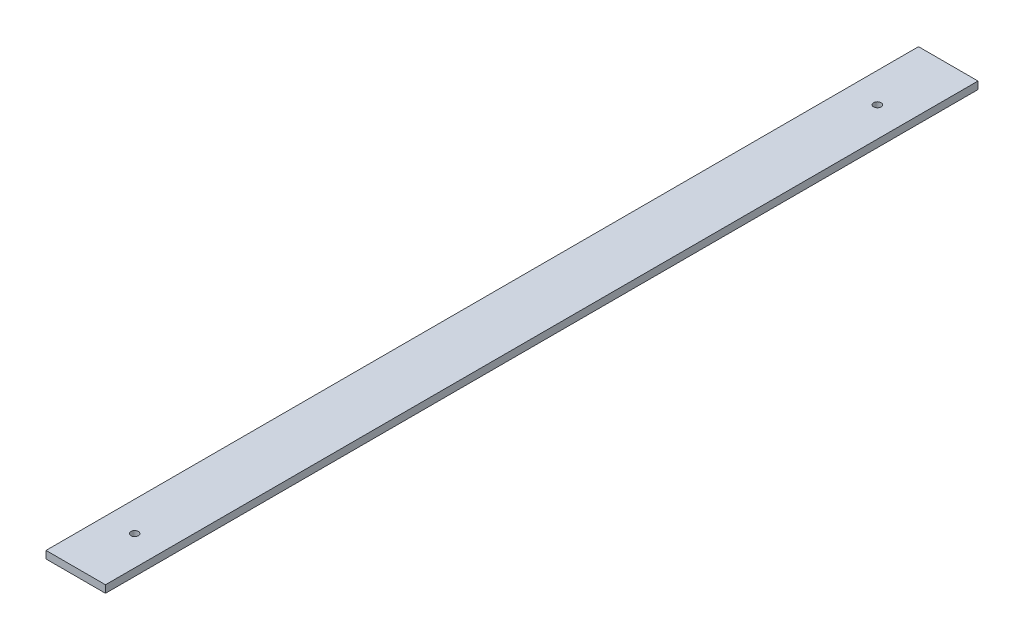
ISO-10303-21;
HEADER;
FILE_DESCRIPTION(('STEP AP214'),'2;1');
FILE_NAME('part.step','',(''),(''),'','','');
FILE_SCHEMA(('AUTOMOTIVE_DESIGN { 1 0 10303 214 1 1 1 1 }'));
ENDSEC;
DATA;
#1=APPLICATION_CONTEXT('core data for automotive mechanical design processes');
#2=APPLICATION_PROTOCOL_DEFINITION('international standard','automotive_design',2000,#1);
#3=PRODUCT_CONTEXT('',#1,'mechanical');
#4=PRODUCT('Part','Part','',(#3));
#5=PRODUCT_RELATED_PRODUCT_CATEGORY('part','',(#4));
#6=PRODUCT_DEFINITION_FORMATION('','',#4);
#7=PRODUCT_DEFINITION_CONTEXT('part definition',#1,'design');
#8=PRODUCT_DEFINITION('design','',#6,#7);
#9=PRODUCT_DEFINITION_SHAPE('','',#8);
#10=(LENGTH_UNIT() NAMED_UNIT(*) SI_UNIT(.MILLI.,.METRE.));
#11=(NAMED_UNIT(*) PLANE_ANGLE_UNIT() SI_UNIT($,.RADIAN.));
#12=(NAMED_UNIT(*) SI_UNIT($,.STERADIAN.) SOLID_ANGLE_UNIT());
#13=UNCERTAINTY_MEASURE_WITH_UNIT(LENGTH_MEASURE(1.E-05),#10,'distance_accuracy_value','');
#14=(GEOMETRIC_REPRESENTATION_CONTEXT(3) GLOBAL_UNCERTAINTY_ASSIGNED_CONTEXT((#13)) GLOBAL_UNIT_ASSIGNED_CONTEXT((#10,
#11,#12)) REPRESENTATION_CONTEXT('',''));
#15=CARTESIAN_POINT('',(0.,0.,0.));
#16=DIRECTION('',(0.,0.,1.));
#17=DIRECTION('',(1.,0.,0.));
#18=AXIS2_PLACEMENT_3D('',#15,#16,#17);
#19=CARTESIAN_POINT('',(0.,25.,0.));
#20=DIRECTION('',(0.,-1.,0.));
#21=DIRECTION('',(0.,0.,-1.));
#22=AXIS2_PLACEMENT_3D('',#19,#20,#21);
#23=PLANE('',#22);
#24=DIRECTION('',(0.,0.,-1.));
#25=VECTOR('',#24,1.);
#26=CARTESIAN_POINT('',(23232.9446458133,25.,9942.5828739722));
#27=LINE('',#26,#25);
#28=CARTESIAN_POINT('',(23232.9446458133,25.,12876.1567480987));
#29=VERTEX_POINT('',#28);
#30=CARTESIAN_POINT('',(23232.9446458133,25.,9942.5828739722));
#31=VERTEX_POINT('',#30);
#32=EDGE_CURVE('E102',#29,#31,#27,.T.);
#33=ORIENTED_EDGE('',*,*,#32,.T.);
#34=DIRECTION('',(-1.,0.,0.));
#35=VECTOR('',#34,1.);
#36=CARTESIAN_POINT('',(23232.9446458133,25.,9942.5828739722));
#37=LINE('',#36,#35);
#38=CARTESIAN_POINT('',(23032.9446458133,25.,9942.5828739722));
#39=VERTEX_POINT('',#38);
#40=EDGE_CURVE('E97',#31,#39,#37,.T.);
#41=ORIENTED_EDGE('',*,*,#40,.T.);
#42=DIRECTION('',(0.,0.,1.));
#43=VECTOR('',#42,1.);
#44=CARTESIAN_POINT('',(23032.9446458133,25.,9942.5828739722));
#45=LINE('',#44,#43);
#46=CARTESIAN_POINT('',(23032.9446458133,25.,12876.1567480987));
#47=VERTEX_POINT('',#46);
#48=EDGE_CURVE('E100',#39,#47,#45,.T.);
#49=ORIENTED_EDGE('',*,*,#48,.T.);
#50=DIRECTION('',(1.,0.,0.));
#51=VECTOR('',#50,1.);
#52=CARTESIAN_POINT('',(23232.9446458133,25.,12876.1567480987));
#53=LINE('',#52,#51);
#54=EDGE_CURVE('E67',#47,#29,#53,.T.);
#55=ORIENTED_EDGE('',*,*,#54,.T.);
#56=EDGE_LOOP('',(#33,#41,#49,#55));
#57=FACE_BOUND('',#56,.T.);
#58=CARTESIAN_POINT('',(23132.9446458133,25.,12678.089615367));
#59=DIRECTION('',(0.,1.,0.));
#60=DIRECTION('',(0.,0.,1.));
#61=AXIS2_PLACEMENT_3D('',#58,#59,#60);
#62=CIRCLE('',#61,12.4999999999988);
#63=CARTESIAN_POINT('',(23132.9446458133,25.,12690.589615367));
#64=VERTEX_POINT('',#63);
#65=EDGE_CURVE('E117',#64,#64,#62,.T.);
#66=ORIENTED_EDGE('',*,*,#65,.F.);
#67=EDGE_LOOP('',(#66));
#68=FACE_BOUND('',#67,.T.);
#69=CARTESIAN_POINT('',(23132.9446458133,25.,10181.0304593336));
#70=DIRECTION('',(0.,1.,0.));
#71=DIRECTION('',(0.,0.,1.));
#72=AXIS2_PLACEMENT_3D('',#69,#70,#71);
#73=CIRCLE('',#72,12.4999999999988);
#74=CARTESIAN_POINT('',(23132.9446458133,25.,10193.5304593336));
#75=VERTEX_POINT('',#74);
#76=EDGE_CURVE('E132',#75,#75,#73,.T.);
#77=ORIENTED_EDGE('',*,*,#76,.F.);
#78=EDGE_LOOP('',(#77));
#79=FACE_BOUND('',#78,.T.);
#80=ADVANCED_FACE('F50',(#57,#68,#79),#23,.F.);
#81=CARTESIAN_POINT('',(0.,0.,0.));
#82=DIRECTION('',(0.,-1.,0.));
#83=DIRECTION('',(0.,0.,-1.));
#84=AXIS2_PLACEMENT_3D('',#81,#82,#83);
#85=PLANE('',#84);
#86=CARTESIAN_POINT('',(23132.9446458133,0.,12678.089615367));
#87=DIRECTION('',(0.,1.,0.));
#88=DIRECTION('',(0.,0.,1.));
#89=AXIS2_PLACEMENT_3D('',#86,#87,#88);
#90=CIRCLE('',#89,12.4999999999988);
#91=CARTESIAN_POINT('',(23132.9446458133,0.,12690.589615367));
#92=VERTEX_POINT('',#91);
#93=EDGE_CURVE('E129',#92,#92,#90,.T.);
#94=ORIENTED_EDGE('',*,*,#93,.T.);
#95=EDGE_LOOP('',(#94));
#96=FACE_BOUND('',#95,.T.);
#97=DIRECTION('',(0.,0.,-1.));
#98=VECTOR('',#97,1.);
#99=CARTESIAN_POINT('',(23232.9446458133,0.,9942.5828739722));
#100=LINE('',#99,#98);
#101=CARTESIAN_POINT('',(23232.9446458133,0.,12876.1567480987));
#102=VERTEX_POINT('',#101);
#103=CARTESIAN_POINT('',(23232.9446458133,0.,9942.5828739722));
#104=VERTEX_POINT('',#103);
#105=EDGE_CURVE('E114',#102,#104,#100,.T.);
#106=ORIENTED_EDGE('',*,*,#105,.F.);
#107=DIRECTION('',(1.,0.,0.));
#108=VECTOR('',#107,1.);
#109=CARTESIAN_POINT('',(23232.9446458133,0.,12876.1567480987));
#110=LINE('',#109,#108);
#111=CARTESIAN_POINT('',(23032.9446458133,0.,12876.1567480987));
#112=VERTEX_POINT('',#111);
#113=EDGE_CURVE('E90',#112,#102,#110,.T.);
#114=ORIENTED_EDGE('',*,*,#113,.F.);
#115=DIRECTION('',(0.,0.,1.));
#116=VECTOR('',#115,1.);
#117=CARTESIAN_POINT('',(23032.9446458133,0.,9942.5828739722));
#118=LINE('',#117,#116);
#119=CARTESIAN_POINT('',(23032.9446458133,0.,9942.5828739722));
#120=VERTEX_POINT('',#119);
#121=EDGE_CURVE('E84',#120,#112,#118,.T.);
#122=ORIENTED_EDGE('',*,*,#121,.F.);
#123=DIRECTION('',(-1.,0.,0.));
#124=VECTOR('',#123,1.);
#125=CARTESIAN_POINT('',(23232.9446458133,0.,9942.5828739722));
#126=LINE('',#125,#124);
#127=EDGE_CURVE('E106',#104,#120,#126,.T.);
#128=ORIENTED_EDGE('',*,*,#127,.F.);
#129=EDGE_LOOP('',(#106,#114,#122,#128));
#130=FACE_BOUND('',#129,.T.);
#131=CARTESIAN_POINT('',(23132.9446458133,0.,10181.0304593336));
#132=DIRECTION('',(0.,1.,0.));
#133=DIRECTION('',(0.,0.,1.));
#134=AXIS2_PLACEMENT_3D('',#131,#132,#133);
#135=CIRCLE('',#134,12.4999999999988);
#136=CARTESIAN_POINT('',(23132.9446458133,0.,10193.5304593336));
#137=VERTEX_POINT('',#136);
#138=EDGE_CURVE('E135',#137,#137,#135,.T.);
#139=ORIENTED_EDGE('',*,*,#138,.T.);
#140=EDGE_LOOP('',(#139));
#141=FACE_BOUND('',#140,.T.);
#142=ADVANCED_FACE('F125',(#96,#130,#141),#85,.T.);
#143=CARTESIAN_POINT('',(23232.9446458133,25.,9942.5828739722));
#144=DIRECTION('',(-1.,0.,0.));
#145=DIRECTION('',(0.,0.,1.));
#146=AXIS2_PLACEMENT_3D('',#143,#144,#145);
#147=PLANE('',#146);
#148=ORIENTED_EDGE('',*,*,#105,.T.);
#149=DIRECTION('',(0.,-1.,0.));
#150=VECTOR('',#149,1.);
#151=CARTESIAN_POINT('',(23232.9446458133,25.,9942.5828739722));
#152=LINE('',#151,#150);
#153=EDGE_CURVE('E13',#31,#104,#152,.T.);
#154=ORIENTED_EDGE('',*,*,#153,.F.);
#155=ORIENTED_EDGE('',*,*,#32,.F.);
#156=DIRECTION('',(0.,-1.,0.));
#157=VECTOR('',#156,1.);
#158=CARTESIAN_POINT('',(23232.9446458133,25.,12876.1567480987));
#159=LINE('',#158,#157);
#160=EDGE_CURVE('E110',#29,#102,#159,.T.);
#161=ORIENTED_EDGE('',*,*,#160,.T.);
#162=EDGE_LOOP('',(#148,#154,#155,#161));
#163=FACE_BOUND('',#162,.T.);
#164=ADVANCED_FACE('F52',(#163),#147,.F.);
#165=CARTESIAN_POINT('',(23232.9446458133,25.,9942.5828739722));
#166=DIRECTION('',(0.,0.,1.));
#167=DIRECTION('',(1.,0.,0.));
#168=AXIS2_PLACEMENT_3D('',#165,#166,#167);
#169=PLANE('',#168);
#170=ORIENTED_EDGE('',*,*,#127,.T.);
#171=DIRECTION('',(0.,-1.,0.));
#172=VECTOR('',#171,1.);
#173=CARTESIAN_POINT('',(23032.9446458133,25.,9942.5828739722));
#174=LINE('',#173,#172);
#175=EDGE_CURVE('E59',#39,#120,#174,.T.);
#176=ORIENTED_EDGE('',*,*,#175,.F.);
#177=ORIENTED_EDGE('',*,*,#40,.F.);
#178=ORIENTED_EDGE('',*,*,#153,.T.);
#179=EDGE_LOOP('',(#170,#176,#177,#178));
#180=FACE_BOUND('',#179,.T.);
#181=ADVANCED_FACE('F105',(#180),#169,.F.);
#182=CARTESIAN_POINT('',(23032.9446458133,25.,9942.5828739722));
#183=DIRECTION('',(1.,0.,0.));
#184=DIRECTION('',(0.,0.,-1.));
#185=AXIS2_PLACEMENT_3D('',#182,#183,#184);
#186=PLANE('',#185);
#187=ORIENTED_EDGE('',*,*,#121,.T.);
#188=DIRECTION('',(0.,-1.,0.));
#189=VECTOR('',#188,1.);
#190=CARTESIAN_POINT('',(23032.9446458133,25.,12876.1567480987));
#191=LINE('',#190,#189);
#192=EDGE_CURVE('E107',#47,#112,#191,.T.);
#193=ORIENTED_EDGE('',*,*,#192,.F.);
#194=ORIENTED_EDGE('',*,*,#48,.F.);
#195=ORIENTED_EDGE('',*,*,#175,.T.);
#196=EDGE_LOOP('',(#187,#193,#194,#195));
#197=FACE_BOUND('',#196,.T.);
#198=ADVANCED_FACE('F108',(#197),#186,.F.);
#199=CARTESIAN_POINT('',(23232.9446458133,25.,12876.1567480987));
#200=DIRECTION('',(0.,0.,-1.));
#201=DIRECTION('',(-1.,0.,0.));
#202=AXIS2_PLACEMENT_3D('',#199,#200,#201);
#203=PLANE('',#202);
#204=ORIENTED_EDGE('',*,*,#113,.T.);
#205=ORIENTED_EDGE('',*,*,#160,.F.);
#206=ORIENTED_EDGE('',*,*,#54,.F.);
#207=ORIENTED_EDGE('',*,*,#192,.T.);
#208=EDGE_LOOP('',(#204,#205,#206,#207));
#209=FACE_BOUND('',#208,.T.);
#210=ADVANCED_FACE('F122',(#209),#203,.F.);
#211=CARTESIAN_POINT('',(23132.9446458133,25.,12678.089615367));
#212=DIRECTION('',(0.,-1.,0.));
#213=DIRECTION('',(0.,0.,-1.));
#214=AXIS2_PLACEMENT_3D('',#211,#212,#213);
#215=CYLINDRICAL_SURFACE('',#214,12.4999999999988);
#216=ORIENTED_EDGE('',*,*,#65,.T.);
#217=EDGE_LOOP('',(#216));
#218=FACE_BOUND('',#217,.T.);
#219=ORIENTED_EDGE('',*,*,#93,.F.);
#220=EDGE_LOOP('',(#219));
#221=FACE_BOUND('',#220,.T.);
#222=ADVANCED_FACE('F152',(#218,#221),#215,.F.);
#223=CARTESIAN_POINT('',(23132.9446458133,25.,10181.0304593336));
#224=DIRECTION('',(0.,-1.,0.));
#225=DIRECTION('',(0.,0.,-1.));
#226=AXIS2_PLACEMENT_3D('',#223,#224,#225);
#227=CYLINDRICAL_SURFACE('',#226,12.4999999999988);
#228=ORIENTED_EDGE('',*,*,#76,.T.);
#229=EDGE_LOOP('',(#228));
#230=FACE_BOUND('',#229,.T.);
#231=ORIENTED_EDGE('',*,*,#138,.F.);
#232=EDGE_LOOP('',(#231));
#233=FACE_BOUND('',#232,.T.);
#234=ADVANCED_FACE('F141',(#230,#233),#227,.F.);
#235=CLOSED_SHELL('',(#80,#142,#164,#181,#198,#210,#222,#234));
#236=MANIFOLD_SOLID_BREP('B2',#235);
#237=ADVANCED_BREP_SHAPE_REPRESENTATION('',(#18,#236),#14);
#238=SHAPE_DEFINITION_REPRESENTATION(#9,#237);
ENDSEC;
END-ISO-10303-21;
